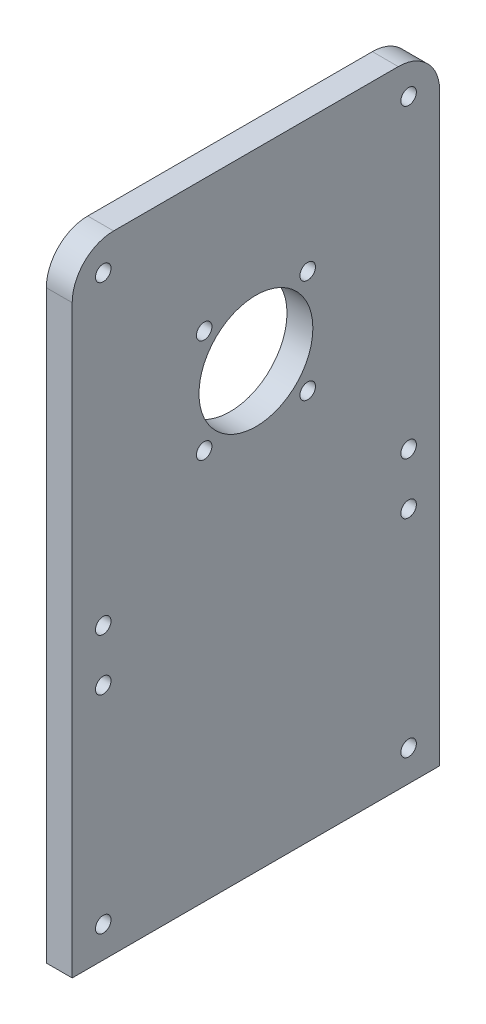
ISO-10303-21;
HEADER;
FILE_DESCRIPTION(('STEP AP214'),'2;1');
FILE_NAME('part.step','',(''),(''),'','','');
FILE_SCHEMA(('AUTOMOTIVE_DESIGN { 1 0 10303 214 1 1 1 1 }'));
ENDSEC;
DATA;
#1=APPLICATION_CONTEXT('core data for automotive mechanical design processes');
#2=APPLICATION_PROTOCOL_DEFINITION('international standard','automotive_design',2000,#1);
#3=PRODUCT_CONTEXT('',#1,'mechanical');
#4=PRODUCT('Part','Part','',(#3));
#5=PRODUCT_RELATED_PRODUCT_CATEGORY('part','',(#4));
#6=PRODUCT_DEFINITION_FORMATION('','',#4);
#7=PRODUCT_DEFINITION_CONTEXT('part definition',#1,'design');
#8=PRODUCT_DEFINITION('design','',#6,#7);
#9=PRODUCT_DEFINITION_SHAPE('','',#8);
#10=(LENGTH_UNIT() NAMED_UNIT(*) SI_UNIT(.MILLI.,.METRE.));
#11=(NAMED_UNIT(*) PLANE_ANGLE_UNIT() SI_UNIT($,.RADIAN.));
#12=(NAMED_UNIT(*) SI_UNIT($,.STERADIAN.) SOLID_ANGLE_UNIT());
#13=UNCERTAINTY_MEASURE_WITH_UNIT(LENGTH_MEASURE(1.E-05),#10,'distance_accuracy_value','');
#14=(GEOMETRIC_REPRESENTATION_CONTEXT(3) GLOBAL_UNCERTAINTY_ASSIGNED_CONTEXT((#13)) GLOBAL_UNIT_ASSIGNED_CONTEXT((#10,
#11,#12)) REPRESENTATION_CONTEXT('',''));
#15=CARTESIAN_POINT('',(0.,0.,0.));
#16=DIRECTION('',(0.,0.,1.));
#17=DIRECTION('',(1.,0.,0.));
#18=AXIS2_PLACEMENT_3D('',#15,#16,#17);
#19=CARTESIAN_POINT('',(5.,0.,0.));
#20=DIRECTION('',(-1.,0.,0.));
#21=DIRECTION('',(0.,0.,1.));
#22=AXIS2_PLACEMENT_3D('',#19,#20,#21);
#23=PLANE('',#22);
#24=CARTESIAN_POINT('',(5.,46.,-6.));
#25=DIRECTION('',(1.,0.,0.));
#26=DIRECTION('',(0.,0.,-1.));
#27=AXIS2_PLACEMENT_3D('',#24,#25,#26);
#28=CIRCLE('',#27,1.5);
#29=CARTESIAN_POINT('',(5.,46.,-7.5));
#30=VERTEX_POINT('',#29);
#31=EDGE_CURVE('E210',#30,#30,#28,.T.);
#32=ORIENTED_EDGE('',*,*,#31,.F.);
#33=EDGE_LOOP('',(#32));
#34=FACE_BOUND('',#33,.T.);
#35=CARTESIAN_POINT('',(5.,6.,-6.));
#36=DIRECTION('',(1.,0.,0.));
#37=DIRECTION('',(0.,0.,-1.));
#38=AXIS2_PLACEMENT_3D('',#35,#36,#37);
#39=CIRCLE('',#38,1.5);
#40=CARTESIAN_POINT('',(5.,6.,-7.5));
#41=VERTEX_POINT('',#40);
#42=EDGE_CURVE('E198',#41,#41,#39,.T.);
#43=ORIENTED_EDGE('',*,*,#42,.F.);
#44=EDGE_LOOP('',(#43));
#45=FACE_BOUND('',#44,.T.);
#46=CARTESIAN_POINT('',(5.,56.,-6.));
#47=DIRECTION('',(1.,0.,0.));
#48=DIRECTION('',(0.,0.,-1.));
#49=AXIS2_PLACEMENT_3D('',#46,#47,#48);
#50=CIRCLE('',#49,1.5);
#51=CARTESIAN_POINT('',(5.,56.,-7.5));
#52=VERTEX_POINT('',#51);
#53=EDGE_CURVE('E186',#52,#52,#50,.T.);
#54=ORIENTED_EDGE('',*,*,#53,.F.);
#55=EDGE_LOOP('',(#54));
#56=FACE_BOUND('',#55,.T.);
#57=CARTESIAN_POINT('',(5.,75.5,-45.5));
#58=DIRECTION('',(1.,0.,0.));
#59=DIRECTION('',(0.,0.,-1.));
#60=AXIS2_PLACEMENT_3D('',#57,#58,#59);
#61=CIRCLE('',#60,1.5);
#62=CARTESIAN_POINT('',(5.,75.5,-47.));
#63=VERTEX_POINT('',#62);
#64=EDGE_CURVE('E174',#63,#63,#61,.T.);
#65=ORIENTED_EDGE('',*,*,#64,.F.);
#66=EDGE_LOOP('',(#65));
#67=FACE_BOUND('',#66,.T.);
#68=CARTESIAN_POINT('',(5.,95.5,-25.5));
#69=DIRECTION('',(1.,0.,0.));
#70=DIRECTION('',(0.,0.,-1.));
#71=AXIS2_PLACEMENT_3D('',#68,#69,#70);
#72=CIRCLE('',#71,1.5);
#73=CARTESIAN_POINT('',(5.,95.5,-27.));
#74=VERTEX_POINT('',#73);
#75=EDGE_CURVE('E162',#74,#74,#72,.T.);
#76=ORIENTED_EDGE('',*,*,#75,.F.);
#77=EDGE_LOOP('',(#76));
#78=FACE_BOUND('',#77,.T.);
#79=CARTESIAN_POINT('',(5.,115.,-65.));
#80=DIRECTION('',(1.,0.,0.));
#81=DIRECTION('',(0.,0.,-1.));
#82=AXIS2_PLACEMENT_3D('',#79,#80,#81);
#83=CIRCLE('',#82,1.5);
#84=CARTESIAN_POINT('',(5.,115.,-66.5));
#85=VERTEX_POINT('',#84);
#86=EDGE_CURVE('E150',#85,#85,#83,.T.);
#87=ORIENTED_EDGE('',*,*,#86,.F.);
#88=EDGE_LOOP('',(#87));
#89=FACE_BOUND('',#88,.T.);
#90=DIRECTION('',(0.,1.,0.));
#91=VECTOR('',#90,1.);
#92=CARTESIAN_POINT('',(5.,0.,-71.));
#93=LINE('',#92,#91);
#94=CARTESIAN_POINT('',(5.,0.,-71.));
#95=VERTEX_POINT('',#94);
#96=CARTESIAN_POINT('',(5.,113.,-71.));
#97=VERTEX_POINT('',#96);
#98=EDGE_CURVE('E102',#95,#97,#93,.T.);
#99=ORIENTED_EDGE('',*,*,#98,.T.);
#100=CARTESIAN_POINT('',(5.,113.,-63.));
#101=DIRECTION('',(-1.,0.,0.));
#102=DIRECTION('',(0.,0.,1.));
#103=AXIS2_PLACEMENT_3D('',#100,#101,#102);
#104=CIRCLE('',#103,8.);
#105=CARTESIAN_POINT('',(5.,121.,-63.));
#106=VERTEX_POINT('',#105);
#107=EDGE_CURVE('E41',#97,#106,#104,.F.);
#108=ORIENTED_EDGE('',*,*,#107,.T.);
#109=DIRECTION('',(0.,0.,1.));
#110=VECTOR('',#109,1.);
#111=CARTESIAN_POINT('',(5.,121.,0.));
#112=LINE('',#111,#110);
#113=CARTESIAN_POINT('',(5.,121.,-7.99999999999997));
#114=VERTEX_POINT('',#113);
#115=EDGE_CURVE('E112',#106,#114,#112,.T.);
#116=ORIENTED_EDGE('',*,*,#115,.T.);
#117=CARTESIAN_POINT('',(5.,113.,-7.99999999999997));
#118=DIRECTION('',(-1.,0.,0.));
#119=DIRECTION('',(0.,0.,1.));
#120=AXIS2_PLACEMENT_3D('',#117,#118,#119);
#121=CIRCLE('',#120,8.);
#122=CARTESIAN_POINT('',(5.,113.,0.));
#123=VERTEX_POINT('',#122);
#124=EDGE_CURVE('E48',#114,#123,#121,.F.);
#125=ORIENTED_EDGE('',*,*,#124,.T.);
#126=DIRECTION('',(0.,-1.,0.));
#127=VECTOR('',#126,1.);
#128=CARTESIAN_POINT('',(5.,0.,0.));
#129=LINE('',#128,#127);
#130=CARTESIAN_POINT('',(5.,0.,0.));
#131=VERTEX_POINT('',#130);
#132=EDGE_CURVE('E86',#123,#131,#129,.T.);
#133=ORIENTED_EDGE('',*,*,#132,.T.);
#134=DIRECTION('',(0.,0.,-1.));
#135=VECTOR('',#134,1.);
#136=CARTESIAN_POINT('',(5.,0.,0.));
#137=LINE('',#136,#135);
#138=EDGE_CURVE('E89',#131,#95,#137,.T.);
#139=ORIENTED_EDGE('',*,*,#138,.T.);
#140=EDGE_LOOP('',(#99,#108,#116,#125,#133,#139));
#141=FACE_BOUND('',#140,.T.);
#142=CARTESIAN_POINT('',(5.,115.,-6.));
#143=DIRECTION('',(1.,0.,0.));
#144=DIRECTION('',(0.,0.,-1.));
#145=AXIS2_PLACEMENT_3D('',#142,#143,#144);
#146=CIRCLE('',#145,1.5);
#147=CARTESIAN_POINT('',(5.,115.,-7.5));
#148=VERTEX_POINT('',#147);
#149=EDGE_CURVE('E144',#148,#148,#146,.T.);
#150=ORIENTED_EDGE('',*,*,#149,.F.);
#151=EDGE_LOOP('',(#150));
#152=FACE_BOUND('',#151,.T.);
#153=CARTESIAN_POINT('',(5.,85.5,-35.5));
#154=DIRECTION('',(1.,0.,0.));
#155=DIRECTION('',(0.,0.,-1.));
#156=AXIS2_PLACEMENT_3D('',#153,#154,#155);
#157=CIRCLE('',#156,11.);
#158=CARTESIAN_POINT('',(5.,85.5,-46.5));
#159=VERTEX_POINT('',#158);
#160=EDGE_CURVE('E156',#159,#159,#157,.T.);
#161=ORIENTED_EDGE('',*,*,#160,.F.);
#162=EDGE_LOOP('',(#161));
#163=FACE_BOUND('',#162,.T.);
#164=CARTESIAN_POINT('',(5.,95.5,-45.5));
#165=DIRECTION('',(1.,0.,0.));
#166=DIRECTION('',(0.,0.,-1.));
#167=AXIS2_PLACEMENT_3D('',#164,#165,#166);
#168=CIRCLE('',#167,1.5);
#169=CARTESIAN_POINT('',(5.,95.5,-47.));
#170=VERTEX_POINT('',#169);
#171=EDGE_CURVE('E168',#170,#170,#168,.T.);
#172=ORIENTED_EDGE('',*,*,#171,.F.);
#173=EDGE_LOOP('',(#172));
#174=FACE_BOUND('',#173,.T.);
#175=CARTESIAN_POINT('',(5.,75.5,-25.5));
#176=DIRECTION('',(1.,0.,0.));
#177=DIRECTION('',(0.,0.,-1.));
#178=AXIS2_PLACEMENT_3D('',#175,#176,#177);
#179=CIRCLE('',#178,1.5);
#180=CARTESIAN_POINT('',(5.,75.5,-27.));
#181=VERTEX_POINT('',#180);
#182=EDGE_CURVE('E180',#181,#181,#179,.T.);
#183=ORIENTED_EDGE('',*,*,#182,.F.);
#184=EDGE_LOOP('',(#183));
#185=FACE_BOUND('',#184,.T.);
#186=CARTESIAN_POINT('',(5.,56.,-65.));
#187=DIRECTION('',(1.,0.,0.));
#188=DIRECTION('',(0.,0.,-1.));
#189=AXIS2_PLACEMENT_3D('',#186,#187,#188);
#190=CIRCLE('',#189,1.5);
#191=CARTESIAN_POINT('',(5.,56.,-66.5));
#192=VERTEX_POINT('',#191);
#193=EDGE_CURVE('E192',#192,#192,#190,.T.);
#194=ORIENTED_EDGE('',*,*,#193,.F.);
#195=EDGE_LOOP('',(#194));
#196=FACE_BOUND('',#195,.T.);
#197=CARTESIAN_POINT('',(5.,6.,-65.));
#198=DIRECTION('',(1.,0.,0.));
#199=DIRECTION('',(0.,0.,-1.));
#200=AXIS2_PLACEMENT_3D('',#197,#198,#199);
#201=CIRCLE('',#200,1.5);
#202=CARTESIAN_POINT('',(5.,6.,-66.5));
#203=VERTEX_POINT('',#202);
#204=EDGE_CURVE('E204',#203,#203,#201,.T.);
#205=ORIENTED_EDGE('',*,*,#204,.F.);
#206=EDGE_LOOP('',(#205));
#207=FACE_BOUND('',#206,.T.);
#208=CARTESIAN_POINT('',(5.,46.,-65.));
#209=DIRECTION('',(1.,0.,0.));
#210=DIRECTION('',(0.,0.,-1.));
#211=AXIS2_PLACEMENT_3D('',#208,#209,#210);
#212=CIRCLE('',#211,1.5);
#213=CARTESIAN_POINT('',(5.,46.,-66.5));
#214=VERTEX_POINT('',#213);
#215=EDGE_CURVE('E216',#214,#214,#212,.T.);
#216=ORIENTED_EDGE('',*,*,#215,.F.);
#217=EDGE_LOOP('',(#216));
#218=FACE_BOUND('',#217,.T.);
#219=ADVANCED_FACE('F33',(#34,#45,#56,#67,#78,#89,#141,#152,#163,#174,#185,#196,#207,#218),#23,.F.);
#220=CARTESIAN_POINT('',(0.,0.,0.));
#221=DIRECTION('',(-1.,0.,0.));
#222=DIRECTION('',(0.,0.,1.));
#223=AXIS2_PLACEMENT_3D('',#220,#221,#222);
#224=PLANE('',#223);
#225=CARTESIAN_POINT('',(0.,46.,-6.));
#226=DIRECTION('',(1.,0.,0.));
#227=DIRECTION('',(0.,0.,-1.));
#228=AXIS2_PLACEMENT_3D('',#225,#226,#227);
#229=CIRCLE('',#228,1.5);
#230=CARTESIAN_POINT('',(0.,46.,-7.5));
#231=VERTEX_POINT('',#230);
#232=EDGE_CURVE('E213',#231,#231,#229,.T.);
#233=ORIENTED_EDGE('',*,*,#232,.T.);
#234=EDGE_LOOP('',(#233));
#235=FACE_BOUND('',#234,.T.);
#236=CARTESIAN_POINT('',(0.,6.,-6.));
#237=DIRECTION('',(1.,0.,0.));
#238=DIRECTION('',(0.,0.,-1.));
#239=AXIS2_PLACEMENT_3D('',#236,#237,#238);
#240=CIRCLE('',#239,1.5);
#241=CARTESIAN_POINT('',(0.,6.,-7.5));
#242=VERTEX_POINT('',#241);
#243=EDGE_CURVE('E201',#242,#242,#240,.T.);
#244=ORIENTED_EDGE('',*,*,#243,.T.);
#245=EDGE_LOOP('',(#244));
#246=FACE_BOUND('',#245,.T.);
#247=CARTESIAN_POINT('',(0.,56.,-6.));
#248=DIRECTION('',(1.,0.,0.));
#249=DIRECTION('',(0.,0.,-1.));
#250=AXIS2_PLACEMENT_3D('',#247,#248,#249);
#251=CIRCLE('',#250,1.5);
#252=CARTESIAN_POINT('',(0.,56.,-7.5));
#253=VERTEX_POINT('',#252);
#254=EDGE_CURVE('E189',#253,#253,#251,.T.);
#255=ORIENTED_EDGE('',*,*,#254,.T.);
#256=EDGE_LOOP('',(#255));
#257=FACE_BOUND('',#256,.T.);
#258=CARTESIAN_POINT('',(0.,75.5,-45.5));
#259=DIRECTION('',(1.,0.,0.));
#260=DIRECTION('',(0.,0.,-1.));
#261=AXIS2_PLACEMENT_3D('',#258,#259,#260);
#262=CIRCLE('',#261,1.5);
#263=CARTESIAN_POINT('',(0.,75.5,-47.));
#264=VERTEX_POINT('',#263);
#265=EDGE_CURVE('E177',#264,#264,#262,.T.);
#266=ORIENTED_EDGE('',*,*,#265,.T.);
#267=EDGE_LOOP('',(#266));
#268=FACE_BOUND('',#267,.T.);
#269=CARTESIAN_POINT('',(0.,95.5,-25.5));
#270=DIRECTION('',(1.,0.,0.));
#271=DIRECTION('',(0.,0.,-1.));
#272=AXIS2_PLACEMENT_3D('',#269,#270,#271);
#273=CIRCLE('',#272,1.5);
#274=CARTESIAN_POINT('',(0.,95.5,-27.));
#275=VERTEX_POINT('',#274);
#276=EDGE_CURVE('E165',#275,#275,#273,.T.);
#277=ORIENTED_EDGE('',*,*,#276,.T.);
#278=EDGE_LOOP('',(#277));
#279=FACE_BOUND('',#278,.T.);
#280=CARTESIAN_POINT('',(0.,115.,-65.));
#281=DIRECTION('',(1.,0.,0.));
#282=DIRECTION('',(0.,0.,-1.));
#283=AXIS2_PLACEMENT_3D('',#280,#281,#282);
#284=CIRCLE('',#283,1.5);
#285=CARTESIAN_POINT('',(0.,115.,-66.5));
#286=VERTEX_POINT('',#285);
#287=EDGE_CURVE('E153',#286,#286,#284,.T.);
#288=ORIENTED_EDGE('',*,*,#287,.T.);
#289=EDGE_LOOP('',(#288));
#290=FACE_BOUND('',#289,.T.);
#291=DIRECTION('',(0.,0.,1.));
#292=VECTOR('',#291,1.);
#293=CARTESIAN_POINT('',(0.,121.,0.));
#294=LINE('',#293,#292);
#295=CARTESIAN_POINT('',(0.,121.,-63.));
#296=VERTEX_POINT('',#295);
#297=CARTESIAN_POINT('',(0.,121.,-7.99999999999997));
#298=VERTEX_POINT('',#297);
#299=EDGE_CURVE('E94',#296,#298,#294,.T.);
#300=ORIENTED_EDGE('',*,*,#299,.F.);
#301=CARTESIAN_POINT('',(0.,113.,-63.));
#302=DIRECTION('',(-1.,0.,0.));
#303=DIRECTION('',(0.,0.,1.));
#304=AXIS2_PLACEMENT_3D('',#301,#302,#303);
#305=CIRCLE('',#304,8.);
#306=CARTESIAN_POINT('',(0.,113.,-71.));
#307=VERTEX_POINT('',#306);
#308=EDGE_CURVE('E120',#296,#307,#305,.T.);
#309=ORIENTED_EDGE('',*,*,#308,.T.);
#310=DIRECTION('',(0.,1.,0.));
#311=VECTOR('',#310,1.);
#312=CARTESIAN_POINT('',(0.,0.,-71.));
#313=LINE('',#312,#311);
#314=CARTESIAN_POINT('',(0.,0.,-71.));
#315=VERTEX_POINT('',#314);
#316=EDGE_CURVE('E138',#315,#307,#313,.T.);
#317=ORIENTED_EDGE('',*,*,#316,.F.);
#318=DIRECTION('',(0.,0.,-1.));
#319=VECTOR('',#318,1.);
#320=CARTESIAN_POINT('',(0.,0.,0.));
#321=LINE('',#320,#319);
#322=CARTESIAN_POINT('',(0.,0.,0.));
#323=VERTEX_POINT('',#322);
#324=EDGE_CURVE('E140',#323,#315,#321,.T.);
#325=ORIENTED_EDGE('',*,*,#324,.F.);
#326=DIRECTION('',(0.,-1.,0.));
#327=VECTOR('',#326,1.);
#328=CARTESIAN_POINT('',(0.,0.,0.));
#329=LINE('',#328,#327);
#330=CARTESIAN_POINT('',(0.,113.,0.));
#331=VERTEX_POINT('',#330);
#332=EDGE_CURVE('E106',#331,#323,#329,.T.);
#333=ORIENTED_EDGE('',*,*,#332,.F.);
#334=CARTESIAN_POINT('',(0.,113.,-7.99999999999997));
#335=DIRECTION('',(-1.,0.,0.));
#336=DIRECTION('',(0.,0.,1.));
#337=AXIS2_PLACEMENT_3D('',#334,#335,#336);
#338=CIRCLE('',#337,8.);
#339=EDGE_CURVE('E118',#331,#298,#338,.T.);
#340=ORIENTED_EDGE('',*,*,#339,.T.);
#341=EDGE_LOOP('',(#300,#309,#317,#325,#333,#340));
#342=FACE_BOUND('',#341,.T.);
#343=CARTESIAN_POINT('',(0.,115.,-6.));
#344=DIRECTION('',(1.,0.,0.));
#345=DIRECTION('',(0.,0.,-1.));
#346=AXIS2_PLACEMENT_3D('',#343,#344,#345);
#347=CIRCLE('',#346,1.5);
#348=CARTESIAN_POINT('',(0.,115.,-7.5));
#349=VERTEX_POINT('',#348);
#350=EDGE_CURVE('E147',#349,#349,#347,.T.);
#351=ORIENTED_EDGE('',*,*,#350,.T.);
#352=EDGE_LOOP('',(#351));
#353=FACE_BOUND('',#352,.T.);
#354=CARTESIAN_POINT('',(0.,85.5,-35.5));
#355=DIRECTION('',(1.,0.,0.));
#356=DIRECTION('',(0.,0.,-1.));
#357=AXIS2_PLACEMENT_3D('',#354,#355,#356);
#358=CIRCLE('',#357,11.);
#359=CARTESIAN_POINT('',(0.,85.5,-46.5));
#360=VERTEX_POINT('',#359);
#361=EDGE_CURVE('E159',#360,#360,#358,.T.);
#362=ORIENTED_EDGE('',*,*,#361,.T.);
#363=EDGE_LOOP('',(#362));
#364=FACE_BOUND('',#363,.T.);
#365=CARTESIAN_POINT('',(0.,95.5,-45.5));
#366=DIRECTION('',(1.,0.,0.));
#367=DIRECTION('',(0.,0.,-1.));
#368=AXIS2_PLACEMENT_3D('',#365,#366,#367);
#369=CIRCLE('',#368,1.5);
#370=CARTESIAN_POINT('',(0.,95.5,-47.));
#371=VERTEX_POINT('',#370);
#372=EDGE_CURVE('E171',#371,#371,#369,.T.);
#373=ORIENTED_EDGE('',*,*,#372,.T.);
#374=EDGE_LOOP('',(#373));
#375=FACE_BOUND('',#374,.T.);
#376=CARTESIAN_POINT('',(0.,75.5,-25.5));
#377=DIRECTION('',(1.,0.,0.));
#378=DIRECTION('',(0.,0.,-1.));
#379=AXIS2_PLACEMENT_3D('',#376,#377,#378);
#380=CIRCLE('',#379,1.5);
#381=CARTESIAN_POINT('',(0.,75.5,-27.));
#382=VERTEX_POINT('',#381);
#383=EDGE_CURVE('E183',#382,#382,#380,.T.);
#384=ORIENTED_EDGE('',*,*,#383,.T.);
#385=EDGE_LOOP('',(#384));
#386=FACE_BOUND('',#385,.T.);
#387=CARTESIAN_POINT('',(0.,56.,-65.));
#388=DIRECTION('',(1.,0.,0.));
#389=DIRECTION('',(0.,0.,-1.));
#390=AXIS2_PLACEMENT_3D('',#387,#388,#389);
#391=CIRCLE('',#390,1.5);
#392=CARTESIAN_POINT('',(0.,56.,-66.5));
#393=VERTEX_POINT('',#392);
#394=EDGE_CURVE('E195',#393,#393,#391,.T.);
#395=ORIENTED_EDGE('',*,*,#394,.T.);
#396=EDGE_LOOP('',(#395));
#397=FACE_BOUND('',#396,.T.);
#398=CARTESIAN_POINT('',(0.,6.,-65.));
#399=DIRECTION('',(1.,0.,0.));
#400=DIRECTION('',(0.,0.,-1.));
#401=AXIS2_PLACEMENT_3D('',#398,#399,#400);
#402=CIRCLE('',#401,1.5);
#403=CARTESIAN_POINT('',(0.,6.,-66.5));
#404=VERTEX_POINT('',#403);
#405=EDGE_CURVE('E207',#404,#404,#402,.T.);
#406=ORIENTED_EDGE('',*,*,#405,.T.);
#407=EDGE_LOOP('',(#406));
#408=FACE_BOUND('',#407,.T.);
#409=CARTESIAN_POINT('',(0.,46.,-65.));
#410=DIRECTION('',(1.,0.,0.));
#411=DIRECTION('',(0.,0.,-1.));
#412=AXIS2_PLACEMENT_3D('',#409,#410,#411);
#413=CIRCLE('',#412,1.5);
#414=CARTESIAN_POINT('',(0.,46.,-66.5));
#415=VERTEX_POINT('',#414);
#416=EDGE_CURVE('E219',#415,#415,#413,.T.);
#417=ORIENTED_EDGE('',*,*,#416,.T.);
#418=EDGE_LOOP('',(#417));
#419=FACE_BOUND('',#418,.T.);
#420=ADVANCED_FACE('F136',(#235,#246,#257,#268,#279,#290,#342,#353,#364,#375,#386,#397,#408,
#419),#224,.T.);
#421=CARTESIAN_POINT('',(5.,0.,0.));
#422=DIRECTION('',(0.,0.,-1.));
#423=DIRECTION('',(0.,1.,0.));
#424=AXIS2_PLACEMENT_3D('',#421,#422,#423);
#425=PLANE('',#424);
#426=ORIENTED_EDGE('',*,*,#132,.F.);
#427=DIRECTION('',(-1.,0.,0.));
#428=VECTOR('',#427,1.);
#429=CARTESIAN_POINT('',(5.,113.,0.));
#430=LINE('',#429,#428);
#431=EDGE_CURVE('E11',#123,#331,#430,.T.);
#432=ORIENTED_EDGE('',*,*,#431,.T.);
#433=ORIENTED_EDGE('',*,*,#332,.T.);
#434=DIRECTION('',(-1.,0.,0.));
#435=VECTOR('',#434,1.);
#436=CARTESIAN_POINT('',(5.,0.,0.));
#437=LINE('',#436,#435);
#438=EDGE_CURVE('E99',#131,#323,#437,.T.);
#439=ORIENTED_EDGE('',*,*,#438,.F.);
#440=EDGE_LOOP('',(#426,#432,#433,#439));
#441=FACE_BOUND('',#440,.T.);
#442=ADVANCED_FACE('F104',(#441),#425,.F.);
#443=CARTESIAN_POINT('',(5.,0.,0.));
#444=DIRECTION('',(0.,1.,0.));
#445=DIRECTION('',(0.,0.,1.));
#446=AXIS2_PLACEMENT_3D('',#443,#444,#445);
#447=PLANE('',#446);
#448=ORIENTED_EDGE('',*,*,#324,.T.);
#449=DIRECTION('',(-1.,0.,0.));
#450=VECTOR('',#449,1.);
#451=CARTESIAN_POINT('',(5.,0.,-71.));
#452=LINE('',#451,#450);
#453=EDGE_CURVE('E101',#95,#315,#452,.T.);
#454=ORIENTED_EDGE('',*,*,#453,.F.);
#455=ORIENTED_EDGE('',*,*,#138,.F.);
#456=ORIENTED_EDGE('',*,*,#438,.T.);
#457=EDGE_LOOP('',(#448,#454,#455,#456));
#458=FACE_BOUND('',#457,.T.);
#459=ADVANCED_FACE('F98',(#458),#447,.F.);
#460=CARTESIAN_POINT('',(5.,0.,-71.));
#461=DIRECTION('',(0.,0.,1.));
#462=DIRECTION('',(0.,-1.,0.));
#463=AXIS2_PLACEMENT_3D('',#460,#461,#462);
#464=PLANE('',#463);
#465=ORIENTED_EDGE('',*,*,#316,.T.);
#466=DIRECTION('',(-1.,0.,0.));
#467=VECTOR('',#466,1.);
#468=CARTESIAN_POINT('',(5.,113.,-71.));
#469=LINE('',#468,#467);
#470=EDGE_CURVE('E56',#307,#97,#469,.F.);
#471=ORIENTED_EDGE('',*,*,#470,.T.);
#472=ORIENTED_EDGE('',*,*,#98,.F.);
#473=ORIENTED_EDGE('',*,*,#453,.T.);
#474=EDGE_LOOP('',(#465,#471,#472,#473));
#475=FACE_BOUND('',#474,.T.);
#476=ADVANCED_FACE('F139',(#475),#464,.F.);
#477=CARTESIAN_POINT('',(5.,121.,0.));
#478=DIRECTION('',(0.,-1.,0.));
#479=DIRECTION('',(0.,0.,-1.));
#480=AXIS2_PLACEMENT_3D('',#477,#478,#479);
#481=PLANE('',#480);
#482=ORIENTED_EDGE('',*,*,#115,.F.);
#483=DIRECTION('',(-1.,0.,0.));
#484=VECTOR('',#483,1.);
#485=CARTESIAN_POINT('',(5.,121.,-63.));
#486=LINE('',#485,#484);
#487=EDGE_CURVE('E110',#106,#296,#486,.T.);
#488=ORIENTED_EDGE('',*,*,#487,.T.);
#489=ORIENTED_EDGE('',*,*,#299,.T.);
#490=DIRECTION('',(-1.,0.,0.));
#491=VECTOR('',#490,1.);
#492=CARTESIAN_POINT('',(5.,121.,-7.99999999999997));
#493=LINE('',#492,#491);
#494=EDGE_CURVE('E108',#298,#114,#493,.F.);
#495=ORIENTED_EDGE('',*,*,#494,.T.);
#496=EDGE_LOOP('',(#482,#488,#489,#495));
#497=FACE_BOUND('',#496,.T.);
#498=ADVANCED_FACE('F128',(#497),#481,.F.);
#499=CARTESIAN_POINT('',(5.,115.,-6.));
#500=DIRECTION('',(-1.,0.,0.));
#501=DIRECTION('',(0.,0.,1.));
#502=AXIS2_PLACEMENT_3D('',#499,#500,#501);
#503=CYLINDRICAL_SURFACE('',#502,1.5);
#504=ORIENTED_EDGE('',*,*,#149,.T.);
#505=EDGE_LOOP('',(#504));
#506=FACE_BOUND('',#505,.T.);
#507=ORIENTED_EDGE('',*,*,#350,.F.);
#508=EDGE_LOOP('',(#507));
#509=FACE_BOUND('',#508,.T.);
#510=ADVANCED_FACE('F239',(#506,#509),#503,.F.);
#511=CARTESIAN_POINT('',(5.,115.,-65.));
#512=DIRECTION('',(-1.,0.,0.));
#513=DIRECTION('',(0.,0.,1.));
#514=AXIS2_PLACEMENT_3D('',#511,#512,#513);
#515=CYLINDRICAL_SURFACE('',#514,1.5);
#516=ORIENTED_EDGE('',*,*,#86,.T.);
#517=EDGE_LOOP('',(#516));
#518=FACE_BOUND('',#517,.T.);
#519=ORIENTED_EDGE('',*,*,#287,.F.);
#520=EDGE_LOOP('',(#519));
#521=FACE_BOUND('',#520,.T.);
#522=ADVANCED_FACE('F297',(#518,#521),#515,.F.);
#523=CARTESIAN_POINT('',(5.,85.5,-35.5));
#524=DIRECTION('',(-1.,0.,0.));
#525=DIRECTION('',(0.,0.,1.));
#526=AXIS2_PLACEMENT_3D('',#523,#524,#525);
#527=CYLINDRICAL_SURFACE('',#526,11.);
#528=ORIENTED_EDGE('',*,*,#160,.T.);
#529=EDGE_LOOP('',(#528));
#530=FACE_BOUND('',#529,.T.);
#531=ORIENTED_EDGE('',*,*,#361,.F.);
#532=EDGE_LOOP('',(#531));
#533=FACE_BOUND('',#532,.T.);
#534=ADVANCED_FACE('F294',(#530,#533),#527,.F.);
#535=CARTESIAN_POINT('',(5.,95.5,-25.5));
#536=DIRECTION('',(-1.,0.,0.));
#537=DIRECTION('',(0.,0.,1.));
#538=AXIS2_PLACEMENT_3D('',#535,#536,#537);
#539=CYLINDRICAL_SURFACE('',#538,1.5);
#540=ORIENTED_EDGE('',*,*,#75,.T.);
#541=EDGE_LOOP('',(#540));
#542=FACE_BOUND('',#541,.T.);
#543=ORIENTED_EDGE('',*,*,#276,.F.);
#544=EDGE_LOOP('',(#543));
#545=FACE_BOUND('',#544,.T.);
#546=ADVANCED_FACE('F290',(#542,#545),#539,.F.);
#547=CARTESIAN_POINT('',(5.,95.5,-45.5));
#548=DIRECTION('',(-1.,0.,0.));
#549=DIRECTION('',(0.,0.,1.));
#550=AXIS2_PLACEMENT_3D('',#547,#548,#549);
#551=CYLINDRICAL_SURFACE('',#550,1.5);
#552=ORIENTED_EDGE('',*,*,#171,.T.);
#553=EDGE_LOOP('',(#552));
#554=FACE_BOUND('',#553,.T.);
#555=ORIENTED_EDGE('',*,*,#372,.F.);
#556=EDGE_LOOP('',(#555));
#557=FACE_BOUND('',#556,.T.);
#558=ADVANCED_FACE('F286',(#554,#557),#551,.F.);
#559=CARTESIAN_POINT('',(5.,75.5,-45.5));
#560=DIRECTION('',(-1.,0.,0.));
#561=DIRECTION('',(0.,0.,1.));
#562=AXIS2_PLACEMENT_3D('',#559,#560,#561);
#563=CYLINDRICAL_SURFACE('',#562,1.5);
#564=ORIENTED_EDGE('',*,*,#64,.T.);
#565=EDGE_LOOP('',(#564));
#566=FACE_BOUND('',#565,.T.);
#567=ORIENTED_EDGE('',*,*,#265,.F.);
#568=EDGE_LOOP('',(#567));
#569=FACE_BOUND('',#568,.T.);
#570=ADVANCED_FACE('F282',(#566,#569),#563,.F.);
#571=CARTESIAN_POINT('',(5.,75.5,-25.5));
#572=DIRECTION('',(-1.,0.,0.));
#573=DIRECTION('',(0.,0.,1.));
#574=AXIS2_PLACEMENT_3D('',#571,#572,#573);
#575=CYLINDRICAL_SURFACE('',#574,1.5);
#576=ORIENTED_EDGE('',*,*,#182,.T.);
#577=EDGE_LOOP('',(#576));
#578=FACE_BOUND('',#577,.T.);
#579=ORIENTED_EDGE('',*,*,#383,.F.);
#580=EDGE_LOOP('',(#579));
#581=FACE_BOUND('',#580,.T.);
#582=ADVANCED_FACE('F278',(#578,#581),#575,.F.);
#583=CARTESIAN_POINT('',(5.,56.,-6.));
#584=DIRECTION('',(-1.,0.,0.));
#585=DIRECTION('',(0.,0.,1.));
#586=AXIS2_PLACEMENT_3D('',#583,#584,#585);
#587=CYLINDRICAL_SURFACE('',#586,1.5);
#588=ORIENTED_EDGE('',*,*,#53,.T.);
#589=EDGE_LOOP('',(#588));
#590=FACE_BOUND('',#589,.T.);
#591=ORIENTED_EDGE('',*,*,#254,.F.);
#592=EDGE_LOOP('',(#591));
#593=FACE_BOUND('',#592,.T.);
#594=ADVANCED_FACE('F274',(#590,#593),#587,.F.);
#595=CARTESIAN_POINT('',(5.,56.,-65.));
#596=DIRECTION('',(-1.,0.,0.));
#597=DIRECTION('',(0.,0.,1.));
#598=AXIS2_PLACEMENT_3D('',#595,#596,#597);
#599=CYLINDRICAL_SURFACE('',#598,1.5);
#600=ORIENTED_EDGE('',*,*,#193,.T.);
#601=EDGE_LOOP('',(#600));
#602=FACE_BOUND('',#601,.T.);
#603=ORIENTED_EDGE('',*,*,#394,.F.);
#604=EDGE_LOOP('',(#603));
#605=FACE_BOUND('',#604,.T.);
#606=ADVANCED_FACE('F270',(#602,#605),#599,.F.);
#607=CARTESIAN_POINT('',(5.,6.,-6.));
#608=DIRECTION('',(-1.,0.,0.));
#609=DIRECTION('',(0.,0.,1.));
#610=AXIS2_PLACEMENT_3D('',#607,#608,#609);
#611=CYLINDRICAL_SURFACE('',#610,1.5);
#612=ORIENTED_EDGE('',*,*,#42,.T.);
#613=EDGE_LOOP('',(#612));
#614=FACE_BOUND('',#613,.T.);
#615=ORIENTED_EDGE('',*,*,#243,.F.);
#616=EDGE_LOOP('',(#615));
#617=FACE_BOUND('',#616,.T.);
#618=ADVANCED_FACE('F266',(#614,#617),#611,.F.);
#619=CARTESIAN_POINT('',(5.,6.,-65.));
#620=DIRECTION('',(-1.,0.,0.));
#621=DIRECTION('',(0.,0.,1.));
#622=AXIS2_PLACEMENT_3D('',#619,#620,#621);
#623=CYLINDRICAL_SURFACE('',#622,1.5);
#624=ORIENTED_EDGE('',*,*,#204,.T.);
#625=EDGE_LOOP('',(#624));
#626=FACE_BOUND('',#625,.T.);
#627=ORIENTED_EDGE('',*,*,#405,.F.);
#628=EDGE_LOOP('',(#627));
#629=FACE_BOUND('',#628,.T.);
#630=ADVANCED_FACE('F260',(#626,#629),#623,.F.);
#631=CARTESIAN_POINT('',(5.,46.,-6.));
#632=DIRECTION('',(-1.,0.,0.));
#633=DIRECTION('',(0.,0.,1.));
#634=AXIS2_PLACEMENT_3D('',#631,#632,#633);
#635=CYLINDRICAL_SURFACE('',#634,1.5);
#636=ORIENTED_EDGE('',*,*,#31,.T.);
#637=EDGE_LOOP('',(#636));
#638=FACE_BOUND('',#637,.T.);
#639=ORIENTED_EDGE('',*,*,#232,.F.);
#640=EDGE_LOOP('',(#639));
#641=FACE_BOUND('',#640,.T.);
#642=ADVANCED_FACE('F255',(#638,#641),#635,.F.);
#643=CARTESIAN_POINT('',(5.,46.,-65.));
#644=DIRECTION('',(-1.,0.,0.));
#645=DIRECTION('',(0.,0.,1.));
#646=AXIS2_PLACEMENT_3D('',#643,#644,#645);
#647=CYLINDRICAL_SURFACE('',#646,1.5);
#648=ORIENTED_EDGE('',*,*,#215,.T.);
#649=EDGE_LOOP('',(#648));
#650=FACE_BOUND('',#649,.T.);
#651=ORIENTED_EDGE('',*,*,#416,.F.);
#652=EDGE_LOOP('',(#651));
#653=FACE_BOUND('',#652,.T.);
#654=ADVANCED_FACE('F225',(#650,#653),#647,.F.);
#655=CARTESIAN_POINT('',(5.,113.,-63.));
#656=DIRECTION('',(-1.,0.,0.));
#657=DIRECTION('',(0.,0.,1.));
#658=AXIS2_PLACEMENT_3D('',#655,#656,#657);
#659=CYLINDRICAL_SURFACE('',#658,8.);
#660=ORIENTED_EDGE('',*,*,#107,.F.);
#661=ORIENTED_EDGE('',*,*,#470,.F.);
#662=ORIENTED_EDGE('',*,*,#308,.F.);
#663=ORIENTED_EDGE('',*,*,#487,.F.);
#664=EDGE_LOOP('',(#660,#661,#662,#663));
#665=FACE_BOUND('',#664,.T.);
#666=ADVANCED_FACE('F133',(#665),#659,.T.);
#667=CARTESIAN_POINT('',(5.,113.,-7.99999999999997));
#668=DIRECTION('',(-1.,0.,0.));
#669=DIRECTION('',(0.,0.,1.));
#670=AXIS2_PLACEMENT_3D('',#667,#668,#669);
#671=CYLINDRICAL_SURFACE('',#670,8.);
#672=ORIENTED_EDGE('',*,*,#124,.F.);
#673=ORIENTED_EDGE('',*,*,#494,.F.);
#674=ORIENTED_EDGE('',*,*,#339,.F.);
#675=ORIENTED_EDGE('',*,*,#431,.F.);
#676=EDGE_LOOP('',(#672,#673,#674,#675));
#677=FACE_BOUND('',#676,.T.);
#678=ADVANCED_FACE('F35',(#677),#671,.T.);
#679=CLOSED_SHELL('',(#219,#420,#442,#459,#476,#498,#510,#522,#534,#546,#558,#570,#582,#594,
#606,#618,#630,#642,#654,#666,#678));
#680=MANIFOLD_SOLID_BREP('B2',#679);
#681=ADVANCED_BREP_SHAPE_REPRESENTATION('',(#18,#680),#14);
#682=SHAPE_DEFINITION_REPRESENTATION(#9,#681);
ENDSEC;
END-ISO-10303-21;
